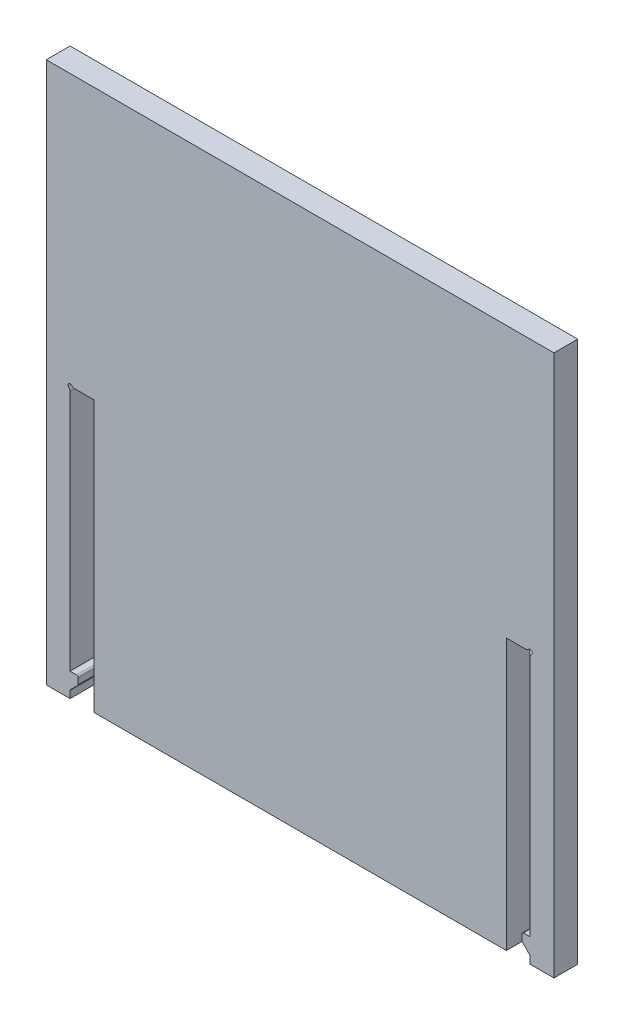
ISO-10303-21;
HEADER;
FILE_DESCRIPTION(('STEP AP214'),'2;1');
FILE_NAME('part.step','',(''),(''),'','','');
FILE_SCHEMA(('AUTOMOTIVE_DESIGN { 1 0 10303 214 1 1 1 1 }'));
ENDSEC;
DATA;
#1=APPLICATION_CONTEXT('core data for automotive mechanical design processes');
#2=APPLICATION_PROTOCOL_DEFINITION('international standard','automotive_design',2000,#1);
#3=PRODUCT_CONTEXT('',#1,'mechanical');
#4=PRODUCT('Part','Part','',(#3));
#5=PRODUCT_RELATED_PRODUCT_CATEGORY('part','',(#4));
#6=PRODUCT_DEFINITION_FORMATION('','',#4);
#7=PRODUCT_DEFINITION_CONTEXT('part definition',#1,'design');
#8=PRODUCT_DEFINITION('design','',#6,#7);
#9=PRODUCT_DEFINITION_SHAPE('','',#8);
#10=(LENGTH_UNIT() NAMED_UNIT(*) SI_UNIT(.MILLI.,.METRE.));
#11=(NAMED_UNIT(*) PLANE_ANGLE_UNIT() SI_UNIT($,.RADIAN.));
#12=(NAMED_UNIT(*) SI_UNIT($,.STERADIAN.) SOLID_ANGLE_UNIT());
#13=UNCERTAINTY_MEASURE_WITH_UNIT(LENGTH_MEASURE(1.E-05),#10,'distance_accuracy_value','');
#14=(GEOMETRIC_REPRESENTATION_CONTEXT(3) GLOBAL_UNCERTAINTY_ASSIGNED_CONTEXT((#13)) GLOBAL_UNIT_ASSIGNED_CONTEXT((#10,
#11,#12)) REPRESENTATION_CONTEXT('',''));
#15=CARTESIAN_POINT('',(0.,0.,0.));
#16=DIRECTION('',(0.,0.,1.));
#17=DIRECTION('',(1.,0.,0.));
#18=AXIS2_PLACEMENT_3D('',#15,#16,#17);
#19=CARTESIAN_POINT('',(28.329999982,-33.3375,0.));
#20=DIRECTION('',(-1.,0.,0.));
#21=DIRECTION('',(0.,0.,1.));
#22=AXIS2_PLACEMENT_3D('',#19,#20,#21);
#23=PLANE('',#22);
#24=DIRECTION('',(0.,-1.,0.));
#25=VECTOR('',#24,1.);
#26=CARTESIAN_POINT('',(28.329999982,-33.3375,2.929999982));
#27=LINE('',#26,#25);
#28=CARTESIAN_POINT('',(28.329999982,-0.559016994374946,2.929999982));
#29=VERTEX_POINT('',#28);
#30=CARTESIAN_POINT('',(28.329999982,-30.407500018,2.929999982));
#31=VERTEX_POINT('',#30);
#32=EDGE_CURVE('E385',#29,#31,#27,.T.);
#33=ORIENTED_EDGE('',*,*,#32,.F.);
#34=DIRECTION('',(0.,0.,1.));
#35=VECTOR('',#34,1.);
#36=CARTESIAN_POINT('',(28.329999982,-0.559016994374946,0.));
#37=LINE('',#36,#35);
#38=CARTESIAN_POINT('',(28.329999982,-0.559016994374946,0.));
#39=VERTEX_POINT('',#38);
#40=EDGE_CURVE('E370',#29,#39,#37,.F.);
#41=ORIENTED_EDGE('',*,*,#40,.T.);
#42=DIRECTION('',(0.,-1.,0.));
#43=VECTOR('',#42,1.);
#44=CARTESIAN_POINT('',(28.329999982,-33.3375,0.));
#45=LINE('',#44,#43);
#46=CARTESIAN_POINT('',(28.329999982,-30.407500018,0.));
#47=VERTEX_POINT('',#46);
#48=EDGE_CURVE('E402',#39,#47,#45,.T.);
#49=ORIENTED_EDGE('',*,*,#48,.T.);
#50=DIRECTION('',(0.,0.,1.));
#51=VECTOR('',#50,1.);
#52=CARTESIAN_POINT('',(28.329999982,-30.407500018,-2.23606529421839));
#53=LINE('',#52,#51);
#54=EDGE_CURVE('E392',#47,#31,#53,.T.);
#55=ORIENTED_EDGE('',*,*,#54,.T.);
#56=EDGE_LOOP('',(#33,#41,#49,#55));
#57=FACE_BOUND('',#56,.T.);
#58=ADVANCED_FACE('F39',(#57),#23,.T.);
#59=CARTESIAN_POINT('',(28.329999982,0.,0.));
#60=DIRECTION('',(0.,-1.,0.));
#61=DIRECTION('',(0.,0.,-1.));
#62=AXIS2_PLACEMENT_3D('',#59,#60,#61);
#63=PLANE('',#62);
#64=DIRECTION('',(1.,0.,0.));
#65=VECTOR('',#64,1.);
#66=CARTESIAN_POINT('',(28.329999982,0.,0.));
#67=LINE('',#66,#65);
#68=CARTESIAN_POINT('',(25.4,0.,0.));
#69=VERTEX_POINT('',#68);
#70=CARTESIAN_POINT('',(27.7709829876251,0.,0.));
#71=VERTEX_POINT('',#70);
#72=EDGE_CURVE('E271',#69,#71,#67,.T.);
#73=ORIENTED_EDGE('',*,*,#72,.T.);
#74=DIRECTION('',(0.,0.,1.));
#75=VECTOR('',#74,1.);
#76=CARTESIAN_POINT('',(27.7709829876251,0.,0.));
#77=LINE('',#76,#75);
#78=CARTESIAN_POINT('',(27.7709829876251,0.,2.929999982));
#79=VERTEX_POINT('',#78);
#80=EDGE_CURVE('E11',#71,#79,#77,.T.);
#81=ORIENTED_EDGE('',*,*,#80,.T.);
#82=DIRECTION('',(1.,0.,0.));
#83=VECTOR('',#82,1.);
#84=CARTESIAN_POINT('',(28.329999982,0.,2.929999982));
#85=LINE('',#84,#83);
#86=CARTESIAN_POINT('',(25.4,0.,2.929999982));
#87=VERTEX_POINT('',#86);
#88=EDGE_CURVE('E394',#87,#79,#85,.T.);
#89=ORIENTED_EDGE('',*,*,#88,.F.);
#90=DIRECTION('',(0.,0.,1.));
#91=VECTOR('',#90,1.);
#92=CARTESIAN_POINT('',(25.4,0.,0.));
#93=LINE('',#92,#91);
#94=EDGE_CURVE('E262',#69,#87,#93,.T.);
#95=ORIENTED_EDGE('',*,*,#94,.F.);
#96=EDGE_LOOP('',(#73,#81,#89,#95));
#97=FACE_BOUND('',#96,.T.);
#98=ADVANCED_FACE('F530',(#97),#63,.T.);
#99=CARTESIAN_POINT('',(28.329999982,-32.4903407304746,2.929999982));
#100=VERTEX_POINT('',#99);
#101=CARTESIAN_POINT('',(28.329999982,-33.3375,2.929999982));
#102=VERTEX_POINT('',#101);
#103=EDGE_CURVE('E395',#100,#102,#27,.T.);
#104=ORIENTED_EDGE('',*,*,#103,.F.);
#105=DIRECTION('',(0.,0.,1.));
#106=VECTOR('',#105,1.);
#107=CARTESIAN_POINT('',(28.329999982,-32.4903407304746,0.));
#108=LINE('',#107,#106);
#109=CARTESIAN_POINT('',(28.329999982,-32.4903407304746,0.));
#110=VERTEX_POINT('',#109);
#111=EDGE_CURVE('E361',#100,#110,#108,.F.);
#112=ORIENTED_EDGE('',*,*,#111,.T.);
#113=CARTESIAN_POINT('',(28.329999982,-33.3375,0.));
#114=VERTEX_POINT('',#113);
#115=EDGE_CURVE('E425',#110,#114,#45,.T.);
#116=ORIENTED_EDGE('',*,*,#115,.T.);
#117=DIRECTION('',(0.,0.,1.));
#118=VECTOR('',#117,1.);
#119=CARTESIAN_POINT('',(28.329999982,-33.3375,0.));
#120=LINE('',#119,#118);
#121=EDGE_CURVE('E261',#114,#102,#120,.T.);
#122=ORIENTED_EDGE('',*,*,#121,.T.);
#123=EDGE_LOOP('',(#104,#112,#116,#122));
#124=FACE_BOUND('',#123,.T.);
#125=ADVANCED_FACE('F532',(#124),#23,.T.);
#126=CARTESIAN_POINT('',(-31.259999964,-33.3375,2.929999982));
#127=DIRECTION('',(0.,1.,0.));
#128=DIRECTION('',(0.,0.,1.));
#129=AXIS2_PLACEMENT_3D('',#126,#127,#128);
#130=PLANE('',#129);
#131=ORIENTED_EDGE('',*,*,#121,.F.);
#132=DIRECTION('',(1.,0.,0.));
#133=VECTOR('',#132,1.);
#134=CARTESIAN_POINT('',(-31.259999964,-33.3375,0.));
#135=LINE('',#134,#133);
#136=CARTESIAN_POINT('',(31.259999964,-33.3375,0.));
#137=VERTEX_POINT('',#136);
#138=EDGE_CURVE('E277',#114,#137,#135,.T.);
#139=ORIENTED_EDGE('',*,*,#138,.T.);
#140=DIRECTION('',(0.,0.,-1.));
#141=VECTOR('',#140,1.);
#142=CARTESIAN_POINT('',(31.259999964,-33.3375,2.929999982));
#143=LINE('',#142,#141);
#144=CARTESIAN_POINT('',(31.259999964,-33.3375,2.929999982));
#145=VERTEX_POINT('',#144);
#146=EDGE_CURVE('E285',#145,#137,#143,.T.);
#147=ORIENTED_EDGE('',*,*,#146,.F.);
#148=DIRECTION('',(1.,0.,0.));
#149=VECTOR('',#148,1.);
#150=CARTESIAN_POINT('',(-31.259999964,-33.3375,2.929999982));
#151=LINE('',#150,#149);
#152=EDGE_CURVE('E490',#102,#145,#151,.T.);
#153=ORIENTED_EDGE('',*,*,#152,.F.);
#154=EDGE_LOOP('',(#131,#139,#147,#153));
#155=FACE_BOUND('',#154,.T.);
#156=ADVANCED_FACE('F540',(#155),#130,.F.);
#157=DIRECTION('',(0.,0.,1.));
#158=VECTOR('',#157,1.);
#159=CARTESIAN_POINT('',(25.4,-33.3375,0.));
#160=LINE('',#159,#158);
#161=CARTESIAN_POINT('',(25.4,-33.3375,0.));
#162=VERTEX_POINT('',#161);
#163=CARTESIAN_POINT('',(25.4,-33.3375,2.929999982));
#164=VERTEX_POINT('',#163);
#165=EDGE_CURVE('E250',#162,#164,#160,.T.);
#166=ORIENTED_EDGE('',*,*,#165,.T.);
#167=CARTESIAN_POINT('',(-25.4,-33.3375,2.929999982));
#168=VERTEX_POINT('',#167);
#169=EDGE_CURVE('E493',#168,#164,#151,.T.);
#170=ORIENTED_EDGE('',*,*,#169,.F.);
#171=DIRECTION('',(0.,0.,1.));
#172=VECTOR('',#171,1.);
#173=CARTESIAN_POINT('',(-25.4,-33.3375,0.));
#174=LINE('',#173,#172);
#175=CARTESIAN_POINT('',(-25.4,-33.3375,0.));
#176=VERTEX_POINT('',#175);
#177=EDGE_CURVE('E275',#176,#168,#174,.T.);
#178=ORIENTED_EDGE('',*,*,#177,.F.);
#179=EDGE_CURVE('E269',#176,#162,#135,.T.);
#180=ORIENTED_EDGE('',*,*,#179,.T.);
#181=EDGE_LOOP('',(#166,#170,#178,#180));
#182=FACE_BOUND('',#181,.T.);
#183=ADVANCED_FACE('F274',(#182),#130,.F.);
#184=CARTESIAN_POINT('',(0.,0.,2.929999982));
#185=DIRECTION('',(0.,0.,1.));
#186=DIRECTION('',(1.,0.,0.));
#187=AXIS2_PLACEMENT_3D('',#184,#185,#186);
#188=PLANE('',#187);
#189=CARTESIAN_POINT('',(28.329999982,0.,2.929999982));
#190=DIRECTION('',(0.,0.,-1.));
#191=DIRECTION('',(-1.,0.,0.));
#192=AXIS2_PLACEMENT_3D('',#189,#190,#191);
#193=CIRCLE('',#192,0.25);
#194=CARTESIAN_POINT('',(28.143660983875,0.166666666666666,2.929999982));
#195=VERTEX_POINT('',#194);
#196=CARTESIAN_POINT('',(28.4966666486667,-0.186338998124983,2.929999982));
#197=VERTEX_POINT('',#196);
#198=EDGE_CURVE('E387',#195,#197,#193,.T.);
#199=ORIENTED_EDGE('',*,*,#198,.T.);
#200=CARTESIAN_POINT('',(28.829999982,-0.559016994374946,2.929999982));
#201=DIRECTION('',(0.,0.,1.));
#202=DIRECTION('',(1.,0.,0.));
#203=AXIS2_PLACEMENT_3D('',#200,#201,#202);
#204=CIRCLE('',#203,0.5);
#205=EDGE_CURVE('E47',#197,#29,#204,.T.);
#206=ORIENTED_EDGE('',*,*,#205,.T.);
#207=ORIENTED_EDGE('',*,*,#32,.T.);
#208=DIRECTION('',(-1.,0.,0.));
#209=VECTOR('',#208,1.);
#210=CARTESIAN_POINT('',(1.05497419248819E-13,-30.4075000180001,2.929999982));
#211=LINE('',#210,#209);
#212=CARTESIAN_POINT('',(27.530001982,-30.407500018,2.929999982));
#213=VERTEX_POINT('',#212);
#214=EDGE_CURVE('E407',#31,#213,#211,.T.);
#215=ORIENTED_EDGE('',*,*,#214,.T.);
#216=CARTESIAN_POINT('',(27.530001982,-30.607500018,2.929999982));
#217=DIRECTION('',(0.,0.,1.));
#218=DIRECTION('',(1.,0.,0.));
#219=AXIS2_PLACEMENT_3D('',#216,#217,#218);
#220=CIRCLE('',#219,0.2);
#221=CARTESIAN_POINT('',(27.330001982,-30.607500018,2.929999982));
#222=VERTEX_POINT('',#221);
#223=EDGE_CURVE('E348',#213,#222,#220,.T.);
#224=ORIENTED_EDGE('',*,*,#223,.T.);
#225=DIRECTION('',(0.,-1.,0.));
#226=VECTOR('',#225,1.);
#227=CARTESIAN_POINT('',(27.330001982,0.,2.929999982));
#228=LINE('',#227,#226);
#229=CARTESIAN_POINT('',(27.330001982,-31.3246573055254,2.929999982));
#230=VERTEX_POINT('',#229);
#231=EDGE_CURVE('E420',#222,#230,#228,.T.);
#232=ORIENTED_EDGE('',*,*,#231,.T.);
#233=CARTESIAN_POINT('',(27.530001982,-31.3246573055254,2.929999982));
#234=DIRECTION('',(0.,0.,1.));
#235=DIRECTION('',(1.,0.,0.));
#236=AXIS2_PLACEMENT_3D('',#233,#234,#235);
#237=CIRCLE('',#236,0.2);
#238=CARTESIAN_POINT('',(27.3885806257627,-31.4660786617627,2.929999982));
#239=VERTEX_POINT('',#238);
#240=EDGE_CURVE('E350',#230,#239,#237,.T.);
#241=ORIENTED_EDGE('',*,*,#240,.T.);
#242=DIRECTION('',(0.707106781186548,-0.707106781186548,0.));
#243=VECTOR('',#242,1.);
#244=CARTESIAN_POINT('',(-2.03874901800001,-2.03874901800001,2.929999982));
#245=LINE('',#244,#243);
#246=CARTESIAN_POINT('',(28.2714213382373,-32.3489193742373,2.929999982));
#247=VERTEX_POINT('',#246);
#248=EDGE_CURVE('E404',#239,#247,#245,.T.);
#249=ORIENTED_EDGE('',*,*,#248,.T.);
#250=CARTESIAN_POINT('',(28.129999982,-32.4903407304746,2.929999982));
#251=DIRECTION('',(0.,0.,1.));
#252=DIRECTION('',(1.,0.,0.));
#253=AXIS2_PLACEMENT_3D('',#250,#251,#252);
#254=CIRCLE('',#253,0.2);
#255=EDGE_CURVE('E366',#247,#100,#254,.F.);
#256=ORIENTED_EDGE('',*,*,#255,.T.);
#257=ORIENTED_EDGE('',*,*,#103,.T.);
#258=ORIENTED_EDGE('',*,*,#152,.T.);
#259=DIRECTION('',(0.,1.,0.));
#260=VECTOR('',#259,1.);
#261=CARTESIAN_POINT('',(31.259999964,33.3375,2.929999982));
#262=LINE('',#261,#260);
#263=CARTESIAN_POINT('',(31.259999964,33.3375,2.929999982));
#264=VERTEX_POINT('',#263);
#265=EDGE_CURVE('E280',#145,#264,#262,.T.);
#266=ORIENTED_EDGE('',*,*,#265,.T.);
#267=DIRECTION('',(-1.,0.,0.));
#268=VECTOR('',#267,1.);
#269=CARTESIAN_POINT('',(-31.259999964,33.3375,2.929999982));
#270=LINE('',#269,#268);
#271=CARTESIAN_POINT('',(-31.259999964,33.3375,2.929999982));
#272=VERTEX_POINT('',#271);
#273=EDGE_CURVE('E486',#264,#272,#270,.T.);
#274=ORIENTED_EDGE('',*,*,#273,.T.);
#275=DIRECTION('',(0.,-1.,0.));
#276=VECTOR('',#275,1.);
#277=CARTESIAN_POINT('',(-31.259999964,33.3375,2.929999982));
#278=LINE('',#277,#276);
#279=CARTESIAN_POINT('',(-31.259999964,-33.3375,2.929999982));
#280=VERTEX_POINT('',#279);
#281=EDGE_CURVE('E488',#272,#280,#278,.T.);
#282=ORIENTED_EDGE('',*,*,#281,.T.);
#283=CARTESIAN_POINT('',(-28.329999982,-33.3375,2.929999982));
#284=VERTEX_POINT('',#283);
#285=EDGE_CURVE('E289',#280,#284,#151,.T.);
#286=ORIENTED_EDGE('',*,*,#285,.T.);
#287=DIRECTION('',(0.,-1.,0.));
#288=VECTOR('',#287,1.);
#289=CARTESIAN_POINT('',(-28.329999982,-33.3375,2.929999982));
#290=LINE('',#289,#288);
#291=CARTESIAN_POINT('',(-28.329999982,-32.4903407304746,2.929999982));
#292=VERTEX_POINT('',#291);
#293=EDGE_CURVE('E447',#292,#284,#290,.T.);
#294=ORIENTED_EDGE('',*,*,#293,.F.);
#295=CARTESIAN_POINT('',(-28.129999982,-32.4903407304746,2.929999982));
#296=DIRECTION('',(0.,0.,1.));
#297=DIRECTION('',(1.,0.,0.));
#298=AXIS2_PLACEMENT_3D('',#295,#296,#297);
#299=CIRCLE('',#298,0.2);
#300=CARTESIAN_POINT('',(-28.2714213382373,-32.3489193742373,2.929999982));
#301=VERTEX_POINT('',#300);
#302=EDGE_CURVE('E321',#292,#301,#299,.F.);
#303=ORIENTED_EDGE('',*,*,#302,.T.);
#304=DIRECTION('',(-0.707106781186548,-0.707106781186548,0.));
#305=VECTOR('',#304,1.);
#306=CARTESIAN_POINT('',(2.03874901800001,-2.03874901800001,2.929999982));
#307=LINE('',#306,#305);
#308=CARTESIAN_POINT('',(-27.3885806257627,-31.4660786617627,2.929999982));
#309=VERTEX_POINT('',#308);
#310=EDGE_CURVE('E437',#309,#301,#307,.T.);
#311=ORIENTED_EDGE('',*,*,#310,.F.);
#312=CARTESIAN_POINT('',(-27.530001982,-31.3246573055254,2.929999982));
#313=DIRECTION('',(0.,0.,1.));
#314=DIRECTION('',(1.,0.,0.));
#315=AXIS2_PLACEMENT_3D('',#312,#313,#314);
#316=CIRCLE('',#315,0.2);
#317=CARTESIAN_POINT('',(-27.330001982,-31.3246573055254,2.929999982));
#318=VERTEX_POINT('',#317);
#319=EDGE_CURVE('E305',#309,#318,#316,.T.);
#320=ORIENTED_EDGE('',*,*,#319,.T.);
#321=DIRECTION('',(0.,-1.,0.));
#322=VECTOR('',#321,1.);
#323=CARTESIAN_POINT('',(-27.330001982,0.,2.929999982));
#324=LINE('',#323,#322);
#325=CARTESIAN_POINT('',(-27.330001982,-30.607500018,2.929999982));
#326=VERTEX_POINT('',#325);
#327=EDGE_CURVE('E450',#326,#318,#324,.T.);
#328=ORIENTED_EDGE('',*,*,#327,.F.);
#329=CARTESIAN_POINT('',(-27.530001982,-30.607500018,2.929999982));
#330=DIRECTION('',(0.,0.,1.));
#331=DIRECTION('',(1.,0.,0.));
#332=AXIS2_PLACEMENT_3D('',#329,#330,#331);
#333=CIRCLE('',#332,0.2);
#334=CARTESIAN_POINT('',(-27.530001982,-30.407500018,2.929999982));
#335=VERTEX_POINT('',#334);
#336=EDGE_CURVE('E303',#326,#335,#333,.T.);
#337=ORIENTED_EDGE('',*,*,#336,.T.);
#338=DIRECTION('',(1.,0.,0.));
#339=VECTOR('',#338,1.);
#340=CARTESIAN_POINT('',(-1.05497419248819E-13,-30.4075000180001,2.929999982));
#341=LINE('',#340,#339);
#342=CARTESIAN_POINT('',(-28.329999982,-30.407500018,2.929999982));
#343=VERTEX_POINT('',#342);
#344=EDGE_CURVE('E453',#343,#335,#341,.T.);
#345=ORIENTED_EDGE('',*,*,#344,.F.);
#346=CARTESIAN_POINT('',(-28.329999982,-0.559016994374946,2.929999982));
#347=VERTEX_POINT('',#346);
#348=EDGE_CURVE('E470',#347,#343,#290,.T.);
#349=ORIENTED_EDGE('',*,*,#348,.F.);
#350=CARTESIAN_POINT('',(-28.829999982,-0.559016994374946,2.929999982));
#351=DIRECTION('',(0.,0.,1.));
#352=DIRECTION('',(1.,0.,0.));
#353=AXIS2_PLACEMENT_3D('',#350,#351,#352);
#354=CIRCLE('',#353,0.5);
#355=CARTESIAN_POINT('',(-28.4966666486667,-0.186338998124983,2.929999982));
#356=VERTEX_POINT('',#355);
#357=EDGE_CURVE('E330',#347,#356,#354,.T.);
#358=ORIENTED_EDGE('',*,*,#357,.T.);
#359=CARTESIAN_POINT('',(-28.329999982,0.,2.929999982));
#360=DIRECTION('',(0.,0.,1.));
#361=DIRECTION('',(1.,0.,0.));
#362=AXIS2_PLACEMENT_3D('',#359,#360,#361);
#363=CIRCLE('',#362,0.25);
#364=CARTESIAN_POINT('',(-28.143660983875,0.166666666666666,2.929999982));
#365=VERTEX_POINT('',#364);
#366=EDGE_CURVE('E431',#365,#356,#363,.T.);
#367=ORIENTED_EDGE('',*,*,#366,.F.);
#368=CARTESIAN_POINT('',(-27.7709829876251,0.5,2.929999982));
#369=DIRECTION('',(0.,0.,1.));
#370=DIRECTION('',(1.,0.,0.));
#371=AXIS2_PLACEMENT_3D('',#368,#369,#370);
#372=CIRCLE('',#371,0.5);
#373=CARTESIAN_POINT('',(-27.7709829876251,0.,2.929999982));
#374=VERTEX_POINT('',#373);
#375=EDGE_CURVE('E328',#365,#374,#372,.T.);
#376=ORIENTED_EDGE('',*,*,#375,.T.);
#377=DIRECTION('',(-1.,0.,0.));
#378=VECTOR('',#377,1.);
#379=CARTESIAN_POINT('',(-28.329999982,0.,2.929999982));
#380=LINE('',#379,#378);
#381=CARTESIAN_POINT('',(-25.4,0.,2.929999982));
#382=VERTEX_POINT('',#381);
#383=EDGE_CURVE('E475',#382,#374,#380,.T.);
#384=ORIENTED_EDGE('',*,*,#383,.F.);
#385=DIRECTION('',(0.,1.,0.));
#386=VECTOR('',#385,1.);
#387=CARTESIAN_POINT('',(-25.4,-33.3375,2.929999982));
#388=LINE('',#387,#386);
#389=EDGE_CURVE('E472',#168,#382,#388,.T.);
#390=ORIENTED_EDGE('',*,*,#389,.F.);
#391=ORIENTED_EDGE('',*,*,#169,.T.);
#392=DIRECTION('',(0.,1.,0.));
#393=VECTOR('',#392,1.);
#394=CARTESIAN_POINT('',(25.4,-33.3375,2.929999982));
#395=LINE('',#394,#393);
#396=EDGE_CURVE('E256',#164,#87,#395,.T.);
#397=ORIENTED_EDGE('',*,*,#396,.T.);
#398=ORIENTED_EDGE('',*,*,#88,.T.);
#399=CARTESIAN_POINT('',(27.7709829876251,0.5,2.929999982));
#400=DIRECTION('',(0.,0.,1.));
#401=DIRECTION('',(1.,0.,0.));
#402=AXIS2_PLACEMENT_3D('',#399,#400,#401);
#403=CIRCLE('',#402,0.5);
#404=EDGE_CURVE('E54',#79,#195,#403,.T.);
#405=ORIENTED_EDGE('',*,*,#404,.T.);
#406=EDGE_LOOP('',(#199,#206,#207,#215,#224,#232,#241,#249,#256,#257,#258,#266,#274,#282,#286,
#294,#303,#311,#320,#328,#337,#345,#349,#358,#367,#376,#384,#390,#391,#397,#398,#405));
#407=FACE_BOUND('',#406,.T.);
#408=ADVANCED_FACE('F383',(#407),#188,.T.);
#409=CARTESIAN_POINT('',(0.,0.,0.));
#410=DIRECTION('',(0.,0.,1.));
#411=DIRECTION('',(1.,0.,0.));
#412=AXIS2_PLACEMENT_3D('',#409,#410,#411);
#413=PLANE('',#412);
#414=ORIENTED_EDGE('',*,*,#48,.F.);
#415=CARTESIAN_POINT('',(28.829999982,-0.559016994374946,0.));
#416=DIRECTION('',(0.,0.,1.));
#417=DIRECTION('',(1.,0.,0.));
#418=AXIS2_PLACEMENT_3D('',#415,#416,#417);
#419=CIRCLE('',#418,0.5);
#420=CARTESIAN_POINT('',(28.4966666486667,-0.186338998124983,0.));
#421=VERTEX_POINT('',#420);
#422=EDGE_CURVE('E375',#39,#421,#419,.F.);
#423=ORIENTED_EDGE('',*,*,#422,.T.);
#424=CARTESIAN_POINT('',(28.329999982,0.,0.));
#425=DIRECTION('',(0.,0.,-1.));
#426=DIRECTION('',(-1.,0.,0.));
#427=AXIS2_PLACEMENT_3D('',#424,#425,#426);
#428=CIRCLE('',#427,0.25);
#429=CARTESIAN_POINT('',(28.143660983875,0.166666666666666,0.));
#430=VERTEX_POINT('',#429);
#431=EDGE_CURVE('E399',#430,#421,#428,.T.);
#432=ORIENTED_EDGE('',*,*,#431,.F.);
#433=CARTESIAN_POINT('',(27.7709829876251,0.5,0.));
#434=DIRECTION('',(0.,0.,1.));
#435=DIRECTION('',(1.,0.,0.));
#436=AXIS2_PLACEMENT_3D('',#433,#434,#435);
#437=CIRCLE('',#436,0.5);
#438=EDGE_CURVE('E373',#430,#71,#437,.F.);
#439=ORIENTED_EDGE('',*,*,#438,.T.);
#440=ORIENTED_EDGE('',*,*,#72,.F.);
#441=DIRECTION('',(0.,1.,0.));
#442=VECTOR('',#441,1.);
#443=CARTESIAN_POINT('',(25.4,-33.3375,0.));
#444=LINE('',#443,#442);
#445=EDGE_CURVE('E253',#162,#69,#444,.T.);
#446=ORIENTED_EDGE('',*,*,#445,.F.);
#447=ORIENTED_EDGE('',*,*,#179,.F.);
#448=DIRECTION('',(0.,1.,0.));
#449=VECTOR('',#448,1.);
#450=CARTESIAN_POINT('',(-25.4,-33.3375,0.));
#451=LINE('',#450,#449);
#452=CARTESIAN_POINT('',(-25.4,0.,0.));
#453=VERTEX_POINT('',#452);
#454=EDGE_CURVE('E463',#176,#453,#451,.T.);
#455=ORIENTED_EDGE('',*,*,#454,.T.);
#456=DIRECTION('',(-1.,0.,0.));
#457=VECTOR('',#456,1.);
#458=CARTESIAN_POINT('',(-28.329999982,0.,0.));
#459=LINE('',#458,#457);
#460=CARTESIAN_POINT('',(-27.7709829876251,0.,0.));
#461=VERTEX_POINT('',#460);
#462=EDGE_CURVE('E466',#453,#461,#459,.T.);
#463=ORIENTED_EDGE('',*,*,#462,.T.);
#464=CARTESIAN_POINT('',(-27.7709829876251,0.5,0.));
#465=DIRECTION('',(0.,0.,1.));
#466=DIRECTION('',(1.,0.,0.));
#467=AXIS2_PLACEMENT_3D('',#464,#465,#466);
#468=CIRCLE('',#467,0.5);
#469=CARTESIAN_POINT('',(-28.143660983875,0.166666666666666,0.));
#470=VERTEX_POINT('',#469);
#471=EDGE_CURVE('E336',#461,#470,#468,.F.);
#472=ORIENTED_EDGE('',*,*,#471,.T.);
#473=CARTESIAN_POINT('',(-28.329999982,0.,0.));
#474=DIRECTION('',(0.,0.,1.));
#475=DIRECTION('',(1.,0.,0.));
#476=AXIS2_PLACEMENT_3D('',#473,#474,#475);
#477=CIRCLE('',#476,0.25);
#478=CARTESIAN_POINT('',(-28.4966666486667,-0.186338998124983,0.));
#479=VERTEX_POINT('',#478);
#480=EDGE_CURVE('E434',#470,#479,#477,.T.);
#481=ORIENTED_EDGE('',*,*,#480,.T.);
#482=CARTESIAN_POINT('',(-28.829999982,-0.559016994374946,0.));
#483=DIRECTION('',(0.,0.,1.));
#484=DIRECTION('',(1.,0.,0.));
#485=AXIS2_PLACEMENT_3D('',#482,#483,#484);
#486=CIRCLE('',#485,0.5);
#487=CARTESIAN_POINT('',(-28.329999982,-0.559016994374946,0.));
#488=VERTEX_POINT('',#487);
#489=EDGE_CURVE('E338',#479,#488,#486,.F.);
#490=ORIENTED_EDGE('',*,*,#489,.T.);
#491=DIRECTION('',(0.,-1.,0.));
#492=VECTOR('',#491,1.);
#493=CARTESIAN_POINT('',(-28.329999982,-33.3375,0.));
#494=LINE('',#493,#492);
#495=CARTESIAN_POINT('',(-28.329999982,-30.407500018,0.));
#496=VERTEX_POINT('',#495);
#497=EDGE_CURVE('E461',#488,#496,#494,.T.);
#498=ORIENTED_EDGE('',*,*,#497,.T.);
#499=DIRECTION('',(-1.,0.,0.));
#500=VECTOR('',#499,1.);
#501=CARTESIAN_POINT('',(-1.05497419248819E-13,-30.4075000180001,0.));
#502=LINE('',#501,#500);
#503=CARTESIAN_POINT('',(-27.530001982,-30.407500018,0.));
#504=VERTEX_POINT('',#503);
#505=EDGE_CURVE('E440',#504,#496,#502,.T.);
#506=ORIENTED_EDGE('',*,*,#505,.F.);
#507=CARTESIAN_POINT('',(-27.530001982,-30.607500018,0.));
#508=DIRECTION('',(0.,0.,1.));
#509=DIRECTION('',(1.,0.,0.));
#510=AXIS2_PLACEMENT_3D('',#507,#508,#509);
#511=CIRCLE('',#510,0.2);
#512=CARTESIAN_POINT('',(-27.330001982,-30.607500018,0.));
#513=VERTEX_POINT('',#512);
#514=EDGE_CURVE('E312',#504,#513,#511,.F.);
#515=ORIENTED_EDGE('',*,*,#514,.T.);
#516=DIRECTION('',(0.,1.,0.));
#517=VECTOR('',#516,1.);
#518=CARTESIAN_POINT('',(-27.330001982,0.,0.));
#519=LINE('',#518,#517);
#520=CARTESIAN_POINT('',(-27.330001982,-31.3246573055254,0.));
#521=VERTEX_POINT('',#520);
#522=EDGE_CURVE('E444',#521,#513,#519,.T.);
#523=ORIENTED_EDGE('',*,*,#522,.F.);
#524=CARTESIAN_POINT('',(-27.530001982,-31.3246573055254,0.));
#525=DIRECTION('',(0.,0.,1.));
#526=DIRECTION('',(1.,0.,0.));
#527=AXIS2_PLACEMENT_3D('',#524,#525,#526);
#528=CIRCLE('',#527,0.2);
#529=CARTESIAN_POINT('',(-27.3885806257627,-31.4660786617627,0.));
#530=VERTEX_POINT('',#529);
#531=EDGE_CURVE('E314',#521,#530,#528,.F.);
#532=ORIENTED_EDGE('',*,*,#531,.T.);
#533=DIRECTION('',(0.707106781186548,0.707106781186548,0.));
#534=VECTOR('',#533,1.);
#535=CARTESIAN_POINT('',(2.03874901800001,-2.03874901800001,0.));
#536=LINE('',#535,#534);
#537=CARTESIAN_POINT('',(-28.2714213382373,-32.3489193742373,0.));
#538=VERTEX_POINT('',#537);
#539=EDGE_CURVE('E443',#538,#530,#536,.T.);
#540=ORIENTED_EDGE('',*,*,#539,.F.);
#541=CARTESIAN_POINT('',(-28.129999982,-32.4903407304746,0.));
#542=DIRECTION('',(0.,0.,1.));
#543=DIRECTION('',(1.,0.,0.));
#544=AXIS2_PLACEMENT_3D('',#541,#542,#543);
#545=CIRCLE('',#544,0.2);
#546=CARTESIAN_POINT('',(-28.329999982,-32.4903407304746,0.));
#547=VERTEX_POINT('',#546);
#548=EDGE_CURVE('E323',#538,#547,#545,.T.);
#549=ORIENTED_EDGE('',*,*,#548,.T.);
#550=CARTESIAN_POINT('',(-28.329999982,-33.3375,0.));
#551=VERTEX_POINT('',#550);
#552=EDGE_CURVE('E464',#547,#551,#494,.T.);
#553=ORIENTED_EDGE('',*,*,#552,.T.);
#554=CARTESIAN_POINT('',(-31.259999964,-33.3375,0.));
#555=VERTEX_POINT('',#554);
#556=EDGE_CURVE('E276',#555,#551,#135,.T.);
#557=ORIENTED_EDGE('',*,*,#556,.F.);
#558=DIRECTION('',(0.,-1.,0.));
#559=VECTOR('',#558,1.);
#560=CARTESIAN_POINT('',(-31.259999964,33.3375,0.));
#561=LINE('',#560,#559);
#562=CARTESIAN_POINT('',(-31.259999964,33.3375,0.));
#563=VERTEX_POINT('',#562);
#564=EDGE_CURVE('E281',#563,#555,#561,.T.);
#565=ORIENTED_EDGE('',*,*,#564,.F.);
#566=DIRECTION('',(-1.,0.,0.));
#567=VECTOR('',#566,1.);
#568=CARTESIAN_POINT('',(-31.259999964,33.3375,0.));
#569=LINE('',#568,#567);
#570=CARTESIAN_POINT('',(31.259999964,33.3375,0.));
#571=VERTEX_POINT('',#570);
#572=EDGE_CURVE('E495',#571,#563,#569,.T.);
#573=ORIENTED_EDGE('',*,*,#572,.F.);
#574=DIRECTION('',(0.,1.,0.));
#575=VECTOR('',#574,1.);
#576=CARTESIAN_POINT('',(31.259999964,33.3375,0.));
#577=LINE('',#576,#575);
#578=EDGE_CURVE('E480',#137,#571,#577,.T.);
#579=ORIENTED_EDGE('',*,*,#578,.F.);
#580=ORIENTED_EDGE('',*,*,#138,.F.);
#581=ORIENTED_EDGE('',*,*,#115,.F.);
#582=CARTESIAN_POINT('',(28.129999982,-32.4903407304746,0.));
#583=DIRECTION('',(0.,0.,1.));
#584=DIRECTION('',(1.,0.,0.));
#585=AXIS2_PLACEMENT_3D('',#582,#583,#584);
#586=CIRCLE('',#585,0.2);
#587=CARTESIAN_POINT('',(28.2714213382373,-32.3489193742373,0.));
#588=VERTEX_POINT('',#587);
#589=EDGE_CURVE('E368',#110,#588,#586,.T.);
#590=ORIENTED_EDGE('',*,*,#589,.T.);
#591=DIRECTION('',(-0.707106781186548,0.707106781186548,0.));
#592=VECTOR('',#591,1.);
#593=CARTESIAN_POINT('',(-2.03874901800001,-2.03874901800001,0.));
#594=LINE('',#593,#592);
#595=CARTESIAN_POINT('',(27.3885806257627,-31.4660786617627,0.));
#596=VERTEX_POINT('',#595);
#597=EDGE_CURVE('E416',#588,#596,#594,.T.);
#598=ORIENTED_EDGE('',*,*,#597,.T.);
#599=CARTESIAN_POINT('',(27.530001982,-31.3246573055254,0.));
#600=DIRECTION('',(0.,0.,1.));
#601=DIRECTION('',(1.,0.,0.));
#602=AXIS2_PLACEMENT_3D('',#599,#600,#601);
#603=CIRCLE('',#602,0.2);
#604=CARTESIAN_POINT('',(27.330001982,-31.3246573055254,0.));
#605=VERTEX_POINT('',#604);
#606=EDGE_CURVE('E359',#596,#605,#603,.F.);
#607=ORIENTED_EDGE('',*,*,#606,.T.);
#608=DIRECTION('',(0.,1.,0.));
#609=VECTOR('',#608,1.);
#610=CARTESIAN_POINT('',(27.330001982,0.,0.));
#611=LINE('',#610,#609);
#612=CARTESIAN_POINT('',(27.330001982,-30.607500018,0.));
#613=VERTEX_POINT('',#612);
#614=EDGE_CURVE('E413',#605,#613,#611,.T.);
#615=ORIENTED_EDGE('',*,*,#614,.T.);
#616=CARTESIAN_POINT('',(27.530001982,-30.607500018,0.));
#617=DIRECTION('',(0.,0.,1.));
#618=DIRECTION('',(1.,0.,0.));
#619=AXIS2_PLACEMENT_3D('',#616,#617,#618);
#620=CIRCLE('',#619,0.2);
#621=CARTESIAN_POINT('',(27.530001982,-30.407500018,0.));
#622=VERTEX_POINT('',#621);
#623=EDGE_CURVE('E357',#613,#622,#620,.F.);
#624=ORIENTED_EDGE('',*,*,#623,.T.);
#625=DIRECTION('',(1.,0.,0.));
#626=VECTOR('',#625,1.);
#627=CARTESIAN_POINT('',(1.05497419248819E-13,-30.4075000180001,0.));
#628=LINE('',#627,#626);
#629=EDGE_CURVE('E411',#622,#47,#628,.T.);
#630=ORIENTED_EDGE('',*,*,#629,.T.);
#631=EDGE_LOOP('',(#414,#423,#432,#439,#440,#446,#447,#455,#463,#472,#481,#490,#498,#506,#515,
#523,#532,#540,#549,#553,#557,#565,#573,#579,#580,#581,#590,#598,#607,#615,#624,#630));
#632=FACE_BOUND('',#631,.T.);
#633=ADVANCED_FACE('F267',(#632),#413,.F.);
#634=CARTESIAN_POINT('',(-28.329999982,-33.3375,0.));
#635=DIRECTION('',(-1.,0.,0.));
#636=DIRECTION('',(0.,0.,1.));
#637=AXIS2_PLACEMENT_3D('',#634,#635,#636);
#638=PLANE('',#637);
#639=ORIENTED_EDGE('',*,*,#497,.F.);
#640=DIRECTION('',(0.,0.,1.));
#641=VECTOR('',#640,1.);
#642=CARTESIAN_POINT('',(-28.329999982,-0.559016994374946,0.));
#643=LINE('',#642,#641);
#644=EDGE_CURVE('E325',#488,#347,#643,.T.);
#645=ORIENTED_EDGE('',*,*,#644,.T.);
#646=ORIENTED_EDGE('',*,*,#348,.T.);
#647=DIRECTION('',(0.,0.,1.));
#648=VECTOR('',#647,1.);
#649=CARTESIAN_POINT('',(-28.329999982,-30.407500018,-2.23606529421839));
#650=LINE('',#649,#648);
#651=EDGE_CURVE('E456',#496,#343,#650,.T.);
#652=ORIENTED_EDGE('',*,*,#651,.F.);
#653=EDGE_LOOP('',(#639,#645,#646,#652));
#654=FACE_BOUND('',#653,.T.);
#655=ADVANCED_FACE('F665',(#654),#638,.F.);
#656=ORIENTED_EDGE('',*,*,#552,.F.);
#657=DIRECTION('',(0.,0.,1.));
#658=VECTOR('',#657,1.);
#659=CARTESIAN_POINT('',(-28.329999982,-32.4903407304746,2.929999982));
#660=LINE('',#659,#658);
#661=EDGE_CURVE('E316',#547,#292,#660,.T.);
#662=ORIENTED_EDGE('',*,*,#661,.T.);
#663=ORIENTED_EDGE('',*,*,#293,.T.);
#664=DIRECTION('',(0.,0.,1.));
#665=VECTOR('',#664,1.);
#666=CARTESIAN_POINT('',(-28.329999982,-33.3375,0.));
#667=LINE('',#666,#665);
#668=EDGE_CURVE('E469',#551,#284,#667,.T.);
#669=ORIENTED_EDGE('',*,*,#668,.F.);
#670=EDGE_LOOP('',(#656,#662,#663,#669));
#671=FACE_BOUND('',#670,.T.);
#672=ADVANCED_FACE('F513',(#671),#638,.F.);
#673=ORIENTED_EDGE('',*,*,#556,.T.);
#674=ORIENTED_EDGE('',*,*,#668,.T.);
#675=ORIENTED_EDGE('',*,*,#285,.F.);
#676=DIRECTION('',(0.,0.,-1.));
#677=VECTOR('',#676,1.);
#678=CARTESIAN_POINT('',(-31.259999964,-33.3375,2.929999982));
#679=LINE('',#678,#677);
#680=EDGE_CURVE('E288',#280,#555,#679,.T.);
#681=ORIENTED_EDGE('',*,*,#680,.T.);
#682=EDGE_LOOP('',(#673,#674,#675,#681));
#683=FACE_BOUND('',#682,.T.);
#684=ADVANCED_FACE('F506',(#683),#130,.F.);
#685=CARTESIAN_POINT('',(31.259999964,33.3375,2.929999982));
#686=DIRECTION('',(-1.,0.,0.));
#687=DIRECTION('',(0.,-1.,0.));
#688=AXIS2_PLACEMENT_3D('',#685,#686,#687);
#689=PLANE('',#688);
#690=ORIENTED_EDGE('',*,*,#578,.T.);
#691=DIRECTION('',(0.,0.,-1.));
#692=VECTOR('',#691,1.);
#693=CARTESIAN_POINT('',(31.259999964,33.3375,2.929999982));
#694=LINE('',#693,#692);
#695=EDGE_CURVE('E295',#264,#571,#694,.T.);
#696=ORIENTED_EDGE('',*,*,#695,.F.);
#697=ORIENTED_EDGE('',*,*,#265,.F.);
#698=ORIENTED_EDGE('',*,*,#146,.T.);
#699=EDGE_LOOP('',(#690,#696,#697,#698));
#700=FACE_BOUND('',#699,.T.);
#701=ADVANCED_FACE('F519',(#700),#689,.F.);
#702=CARTESIAN_POINT('',(-31.259999964,33.3375,2.929999982));
#703=DIRECTION('',(0.,-1.,0.));
#704=DIRECTION('',(0.,0.,-1.));
#705=AXIS2_PLACEMENT_3D('',#702,#703,#704);
#706=PLANE('',#705);
#707=ORIENTED_EDGE('',*,*,#572,.T.);
#708=DIRECTION('',(0.,0.,-1.));
#709=VECTOR('',#708,1.);
#710=CARTESIAN_POINT('',(-31.259999964,33.3375,2.929999982));
#711=LINE('',#710,#709);
#712=EDGE_CURVE('E292',#272,#563,#711,.T.);
#713=ORIENTED_EDGE('',*,*,#712,.F.);
#714=ORIENTED_EDGE('',*,*,#273,.F.);
#715=ORIENTED_EDGE('',*,*,#695,.T.);
#716=EDGE_LOOP('',(#707,#713,#714,#715));
#717=FACE_BOUND('',#716,.T.);
#718=ADVANCED_FACE('F517',(#717),#706,.F.);
#719=CARTESIAN_POINT('',(-31.259999964,33.3375,2.929999982));
#720=DIRECTION('',(1.,0.,0.));
#721=DIRECTION('',(0.,0.,-1.));
#722=AXIS2_PLACEMENT_3D('',#719,#720,#721);
#723=PLANE('',#722);
#724=ORIENTED_EDGE('',*,*,#564,.T.);
#725=ORIENTED_EDGE('',*,*,#680,.F.);
#726=ORIENTED_EDGE('',*,*,#281,.F.);
#727=ORIENTED_EDGE('',*,*,#712,.T.);
#728=EDGE_LOOP('',(#724,#725,#726,#727));
#729=FACE_BOUND('',#728,.T.);
#730=ADVANCED_FACE('F501',(#729),#723,.F.);
#731=CARTESIAN_POINT('',(-28.329999982,0.,0.));
#732=DIRECTION('',(0.,1.,0.));
#733=DIRECTION('',(0.,0.,1.));
#734=AXIS2_PLACEMENT_3D('',#731,#732,#733);
#735=PLANE('',#734);
#736=ORIENTED_EDGE('',*,*,#383,.T.);
#737=DIRECTION('',(0.,0.,1.));
#738=VECTOR('',#737,1.);
#739=CARTESIAN_POINT('',(-27.7709829876251,0.,0.));
#740=LINE('',#739,#738);
#741=EDGE_CURVE('E340',#374,#461,#740,.F.);
#742=ORIENTED_EDGE('',*,*,#741,.T.);
#743=ORIENTED_EDGE('',*,*,#462,.F.);
#744=DIRECTION('',(0.,0.,1.));
#745=VECTOR('',#744,1.);
#746=CARTESIAN_POINT('',(-25.4,0.,0.));
#747=LINE('',#746,#745);
#748=EDGE_CURVE('E478',#453,#382,#747,.T.);
#749=ORIENTED_EDGE('',*,*,#748,.T.);
#750=EDGE_LOOP('',(#736,#742,#743,#749));
#751=FACE_BOUND('',#750,.T.);
#752=ADVANCED_FACE('F525',(#751),#735,.F.);
#753=CARTESIAN_POINT('',(-25.4,-33.3375,0.));
#754=DIRECTION('',(1.,0.,0.));
#755=DIRECTION('',(0.,1.,0.));
#756=AXIS2_PLACEMENT_3D('',#753,#754,#755);
#757=PLANE('',#756);
#758=ORIENTED_EDGE('',*,*,#389,.T.);
#759=ORIENTED_EDGE('',*,*,#748,.F.);
#760=ORIENTED_EDGE('',*,*,#454,.F.);
#761=ORIENTED_EDGE('',*,*,#177,.T.);
#762=EDGE_LOOP('',(#758,#759,#760,#761));
#763=FACE_BOUND('',#762,.T.);
#764=ADVANCED_FACE('F737',(#763),#757,.F.);
#765=CARTESIAN_POINT('',(-27.330001982,0.,-2.23606529421839));
#766=DIRECTION('',(-1.,0.,0.));
#767=DIRECTION('',(0.,0.,1.));
#768=AXIS2_PLACEMENT_3D('',#765,#766,#767);
#769=PLANE('',#768);
#770=ORIENTED_EDGE('',*,*,#327,.T.);
#771=DIRECTION('',(0.,0.,1.));
#772=VECTOR('',#771,1.);
#773=CARTESIAN_POINT('',(-27.330001982,-31.3246573055254,-2.23606529421839));
#774=LINE('',#773,#772);
#775=EDGE_CURVE('E310',#318,#521,#774,.F.);
#776=ORIENTED_EDGE('',*,*,#775,.T.);
#777=ORIENTED_EDGE('',*,*,#522,.T.);
#778=DIRECTION('',(0.,0.,1.));
#779=VECTOR('',#778,1.);
#780=CARTESIAN_POINT('',(-27.330001982,-30.607500018,-2.23606529421839));
#781=LINE('',#780,#779);
#782=EDGE_CURVE('E307',#513,#326,#781,.T.);
#783=ORIENTED_EDGE('',*,*,#782,.T.);
#784=EDGE_LOOP('',(#770,#776,#777,#783));
#785=FACE_BOUND('',#784,.T.);
#786=ADVANCED_FACE('F803',(#785),#769,.F.);
#787=CARTESIAN_POINT('',(-1.05497419248819E-13,-30.4075000180001,-2.23606529421839));
#788=DIRECTION('',(0.,-1.,0.));
#789=DIRECTION('',(1.,0.,0.));
#790=AXIS2_PLACEMENT_3D('',#787,#788,#789);
#791=PLANE('',#790);
#792=ORIENTED_EDGE('',*,*,#344,.T.);
#793=DIRECTION('',(0.,0.,1.));
#794=VECTOR('',#793,1.);
#795=CARTESIAN_POINT('',(-27.530001982,-30.407500018,-2.23606529421839));
#796=LINE('',#795,#794);
#797=EDGE_CURVE('E319',#335,#504,#796,.F.);
#798=ORIENTED_EDGE('',*,*,#797,.T.);
#799=ORIENTED_EDGE('',*,*,#505,.T.);
#800=ORIENTED_EDGE('',*,*,#651,.T.);
#801=EDGE_LOOP('',(#792,#798,#799,#800));
#802=FACE_BOUND('',#801,.T.);
#803=ADVANCED_FACE('F792',(#802),#791,.F.);
#804=CARTESIAN_POINT('',(2.03874901800001,-2.03874901800001,-2.23606529421839));
#805=DIRECTION('',(-0.707106781186548,0.707106781186548,0.));
#806=DIRECTION('',(-0.707106781186548,-0.707106781186548,0.));
#807=AXIS2_PLACEMENT_3D('',#804,#805,#806);
#808=PLANE('',#807);
#809=ORIENTED_EDGE('',*,*,#539,.T.);
#810=DIRECTION('',(0.,0.,1.));
#811=VECTOR('',#810,1.);
#812=CARTESIAN_POINT('',(-27.3885806257627,-31.4660786617627,-2.23606529421839));
#813=LINE('',#812,#811);
#814=EDGE_CURVE('E300',#530,#309,#813,.T.);
#815=ORIENTED_EDGE('',*,*,#814,.T.);
#816=ORIENTED_EDGE('',*,*,#310,.T.);
#817=DIRECTION('',(0.,0.,1.));
#818=VECTOR('',#817,1.);
#819=CARTESIAN_POINT('',(-28.2714213382373,-32.3489193742373,0.));
#820=LINE('',#819,#818);
#821=EDGE_CURVE('E298',#301,#538,#820,.F.);
#822=ORIENTED_EDGE('',*,*,#821,.T.);
#823=EDGE_LOOP('',(#809,#815,#816,#822));
#824=FACE_BOUND('',#823,.T.);
#825=ADVANCED_FACE('F781',(#824),#808,.F.);
#826=CARTESIAN_POINT('',(-27.530001982,-31.3246573055254,-2.23606529421839));
#827=DIRECTION('',(0.,0.,1.));
#828=DIRECTION('',(1.,0.,0.));
#829=AXIS2_PLACEMENT_3D('',#826,#827,#828);
#830=CYLINDRICAL_SURFACE('',#829,0.2);
#831=ORIENTED_EDGE('',*,*,#531,.F.);
#832=ORIENTED_EDGE('',*,*,#775,.F.);
#833=ORIENTED_EDGE('',*,*,#319,.F.);
#834=ORIENTED_EDGE('',*,*,#814,.F.);
#835=EDGE_LOOP('',(#831,#832,#833,#834));
#836=FACE_BOUND('',#835,.T.);
#837=ADVANCED_FACE('F770',(#836),#830,.T.);
#838=CARTESIAN_POINT('',(-28.129999982,-32.4903407304746,0.));
#839=DIRECTION('',(0.,0.,-1.));
#840=DIRECTION('',(-1.,0.,0.));
#841=AXIS2_PLACEMENT_3D('',#838,#839,#840);
#842=CYLINDRICAL_SURFACE('',#841,0.2);
#843=ORIENTED_EDGE('',*,*,#548,.F.);
#844=ORIENTED_EDGE('',*,*,#821,.F.);
#845=ORIENTED_EDGE('',*,*,#302,.F.);
#846=ORIENTED_EDGE('',*,*,#661,.F.);
#847=EDGE_LOOP('',(#843,#844,#845,#846));
#848=FACE_BOUND('',#847,.T.);
#849=ADVANCED_FACE('F760',(#848),#842,.F.);
#850=CARTESIAN_POINT('',(-27.530001982,-30.607500018,-2.23606529421839));
#851=DIRECTION('',(0.,0.,1.));
#852=DIRECTION('',(1.,0.,0.));
#853=AXIS2_PLACEMENT_3D('',#850,#851,#852);
#854=CYLINDRICAL_SURFACE('',#853,0.2);
#855=ORIENTED_EDGE('',*,*,#514,.F.);
#856=ORIENTED_EDGE('',*,*,#797,.F.);
#857=ORIENTED_EDGE('',*,*,#336,.F.);
#858=ORIENTED_EDGE('',*,*,#782,.F.);
#859=EDGE_LOOP('',(#855,#856,#857,#858));
#860=FACE_BOUND('',#859,.T.);
#861=ADVANCED_FACE('F725',(#860),#854,.T.);
#862=CARTESIAN_POINT('',(-28.329999982,0.,0.));
#863=DIRECTION('',(0.,0.,1.));
#864=DIRECTION('',(1.,0.,0.));
#865=AXIS2_PLACEMENT_3D('',#862,#863,#864);
#866=CYLINDRICAL_SURFACE('',#865,0.25);
#867=ORIENTED_EDGE('',*,*,#366,.T.);
#868=DIRECTION('',(0.,0.,1.));
#869=VECTOR('',#868,1.);
#870=CARTESIAN_POINT('',(-28.4966666486667,-0.186338998124982,0.));
#871=LINE('',#870,#869);
#872=EDGE_CURVE('E334',#356,#479,#871,.F.);
#873=ORIENTED_EDGE('',*,*,#872,.T.);
#874=ORIENTED_EDGE('',*,*,#480,.F.);
#875=DIRECTION('',(0.,0.,1.));
#876=VECTOR('',#875,1.);
#877=CARTESIAN_POINT('',(-28.143660983875,0.166666666666666,0.));
#878=LINE('',#877,#876);
#879=EDGE_CURVE('E332',#470,#365,#878,.T.);
#880=ORIENTED_EDGE('',*,*,#879,.T.);
#881=EDGE_LOOP('',(#867,#873,#874,#880));
#882=FACE_BOUND('',#881,.T.);
#883=ADVANCED_FACE('F601',(#882),#866,.F.);
#884=CARTESIAN_POINT('',(-28.829999982,-0.559016994374946,0.));
#885=DIRECTION('',(0.,0.,1.));
#886=DIRECTION('',(1.,0.,0.));
#887=AXIS2_PLACEMENT_3D('',#884,#885,#886);
#888=CYLINDRICAL_SURFACE('',#887,0.5);
#889=ORIENTED_EDGE('',*,*,#489,.F.);
#890=ORIENTED_EDGE('',*,*,#872,.F.);
#891=ORIENTED_EDGE('',*,*,#357,.F.);
#892=ORIENTED_EDGE('',*,*,#644,.F.);
#893=EDGE_LOOP('',(#889,#890,#891,#892));
#894=FACE_BOUND('',#893,.T.);
#895=ADVANCED_FACE('F595',(#894),#888,.T.);
#896=CARTESIAN_POINT('',(-27.7709829876251,0.5,0.));
#897=DIRECTION('',(0.,0.,1.));
#898=DIRECTION('',(1.,0.,0.));
#899=AXIS2_PLACEMENT_3D('',#896,#897,#898);
#900=CYLINDRICAL_SURFACE('',#899,0.5);
#901=ORIENTED_EDGE('',*,*,#375,.F.);
#902=ORIENTED_EDGE('',*,*,#879,.F.);
#903=ORIENTED_EDGE('',*,*,#471,.F.);
#904=ORIENTED_EDGE('',*,*,#741,.F.);
#905=EDGE_LOOP('',(#901,#902,#903,#904));
#906=FACE_BOUND('',#905,.T.);
#907=ADVANCED_FACE('F591',(#906),#900,.T.);
#908=CARTESIAN_POINT('',(25.4,-33.3375,0.));
#909=DIRECTION('',(1.,0.,0.));
#910=DIRECTION('',(0.,1.,0.));
#911=AXIS2_PLACEMENT_3D('',#908,#909,#910);
#912=PLANE('',#911);
#913=ORIENTED_EDGE('',*,*,#396,.F.);
#914=ORIENTED_EDGE('',*,*,#165,.F.);
#915=ORIENTED_EDGE('',*,*,#445,.T.);
#916=ORIENTED_EDGE('',*,*,#94,.T.);
#917=EDGE_LOOP('',(#913,#914,#915,#916));
#918=FACE_BOUND('',#917,.T.);
#919=ADVANCED_FACE('F252',(#918),#912,.T.);
#920=CARTESIAN_POINT('',(-2.03874901800001,-2.03874901800001,-2.23606529421839));
#921=DIRECTION('',(-0.707106781186548,-0.707106781186548,0.));
#922=DIRECTION('',(0.707106781186548,-0.707106781186548,0.));
#923=AXIS2_PLACEMENT_3D('',#920,#921,#922);
#924=PLANE('',#923);
#925=ORIENTED_EDGE('',*,*,#248,.F.);
#926=DIRECTION('',(0.,0.,1.));
#927=VECTOR('',#926,1.);
#928=CARTESIAN_POINT('',(27.3885806257627,-31.4660786617627,-2.23606529421839));
#929=LINE('',#928,#927);
#930=EDGE_CURVE('E355',#239,#596,#929,.F.);
#931=ORIENTED_EDGE('',*,*,#930,.T.);
#932=ORIENTED_EDGE('',*,*,#597,.F.);
#933=DIRECTION('',(0.,0.,1.));
#934=VECTOR('',#933,1.);
#935=CARTESIAN_POINT('',(28.2714213382373,-32.3489193742373,2.929999982));
#936=LINE('',#935,#934);
#937=EDGE_CURVE('E352',#588,#247,#936,.T.);
#938=ORIENTED_EDGE('',*,*,#937,.T.);
#939=EDGE_LOOP('',(#925,#931,#932,#938));
#940=FACE_BOUND('',#939,.T.);
#941=ADVANCED_FACE('F561',(#940),#924,.T.);
#942=CARTESIAN_POINT('',(27.330001982,0.,-2.23606529421839));
#943=DIRECTION('',(-1.,0.,0.));
#944=DIRECTION('',(0.,0.,1.));
#945=AXIS2_PLACEMENT_3D('',#942,#943,#944);
#946=PLANE('',#945);
#947=ORIENTED_EDGE('',*,*,#614,.F.);
#948=DIRECTION('',(0.,0.,1.));
#949=VECTOR('',#948,1.);
#950=CARTESIAN_POINT('',(27.330001982,-31.3246573055254,-2.23606529421839));
#951=LINE('',#950,#949);
#952=EDGE_CURVE('E345',#605,#230,#951,.T.);
#953=ORIENTED_EDGE('',*,*,#952,.T.);
#954=ORIENTED_EDGE('',*,*,#231,.F.);
#955=DIRECTION('',(0.,0.,1.));
#956=VECTOR('',#955,1.);
#957=CARTESIAN_POINT('',(27.330001982,-30.607500018,-2.23606529421839));
#958=LINE('',#957,#956);
#959=EDGE_CURVE('E343',#222,#613,#958,.F.);
#960=ORIENTED_EDGE('',*,*,#959,.T.);
#961=EDGE_LOOP('',(#947,#953,#954,#960));
#962=FACE_BOUND('',#961,.T.);
#963=ADVANCED_FACE('F569',(#962),#946,.T.);
#964=CARTESIAN_POINT('',(1.05497419248819E-13,-30.4075000180001,-2.23606529421839));
#965=DIRECTION('',(0.,1.,0.));
#966=DIRECTION('',(-1.,0.,0.));
#967=AXIS2_PLACEMENT_3D('',#964,#965,#966);
#968=PLANE('',#967);
#969=ORIENTED_EDGE('',*,*,#629,.F.);
#970=DIRECTION('',(0.,0.,1.));
#971=VECTOR('',#970,1.);
#972=CARTESIAN_POINT('',(27.530001982,-30.407500018,-2.23606529421839));
#973=LINE('',#972,#971);
#974=EDGE_CURVE('E363',#622,#213,#973,.T.);
#975=ORIENTED_EDGE('',*,*,#974,.T.);
#976=ORIENTED_EDGE('',*,*,#214,.F.);
#977=ORIENTED_EDGE('',*,*,#54,.F.);
#978=EDGE_LOOP('',(#969,#975,#976,#977));
#979=FACE_BOUND('',#978,.T.);
#980=ADVANCED_FACE('F577',(#979),#968,.T.);
#981=CARTESIAN_POINT('',(27.530001982,-31.3246573055254,-2.23606529421839));
#982=DIRECTION('',(0.,0.,1.));
#983=DIRECTION('',(1.,0.,0.));
#984=AXIS2_PLACEMENT_3D('',#981,#982,#983);
#985=CYLINDRICAL_SURFACE('',#984,0.2);
#986=ORIENTED_EDGE('',*,*,#606,.F.);
#987=ORIENTED_EDGE('',*,*,#930,.F.);
#988=ORIENTED_EDGE('',*,*,#240,.F.);
#989=ORIENTED_EDGE('',*,*,#952,.F.);
#990=EDGE_LOOP('',(#986,#987,#988,#989));
#991=FACE_BOUND('',#990,.T.);
#992=ADVANCED_FACE('F564',(#991),#985,.T.);
#993=CARTESIAN_POINT('',(28.129999982,-32.4903407304746,-2.23606529421839));
#994=DIRECTION('',(0.,0.,-1.));
#995=DIRECTION('',(-1.,0.,0.));
#996=AXIS2_PLACEMENT_3D('',#993,#994,#995);
#997=CYLINDRICAL_SURFACE('',#996,0.2);
#998=ORIENTED_EDGE('',*,*,#589,.F.);
#999=ORIENTED_EDGE('',*,*,#111,.F.);
#1000=ORIENTED_EDGE('',*,*,#255,.F.);
#1001=ORIENTED_EDGE('',*,*,#937,.F.);
#1002=EDGE_LOOP('',(#998,#999,#1000,#1001));
#1003=FACE_BOUND('',#1002,.T.);
#1004=ADVANCED_FACE('F554',(#1003),#997,.F.);
#1005=CARTESIAN_POINT('',(27.530001982,-30.607500018,-2.23606529421839));
#1006=DIRECTION('',(0.,0.,1.));
#1007=DIRECTION('',(1.,0.,0.));
#1008=AXIS2_PLACEMENT_3D('',#1005,#1006,#1007);
#1009=CYLINDRICAL_SURFACE('',#1008,0.2);
#1010=ORIENTED_EDGE('',*,*,#623,.F.);
#1011=ORIENTED_EDGE('',*,*,#959,.F.);
#1012=ORIENTED_EDGE('',*,*,#223,.F.);
#1013=ORIENTED_EDGE('',*,*,#974,.F.);
#1014=EDGE_LOOP('',(#1010,#1011,#1012,#1013));
#1015=FACE_BOUND('',#1014,.T.);
#1016=ADVANCED_FACE('F573',(#1015),#1009,.T.);
#1017=CARTESIAN_POINT('',(28.329999982,0.,0.));
#1018=DIRECTION('',(0.,0.,1.));
#1019=DIRECTION('',(1.,0.,0.));
#1020=AXIS2_PLACEMENT_3D('',#1017,#1018,#1019);
#1021=CYLINDRICAL_SURFACE('',#1020,0.25);
#1022=ORIENTED_EDGE('',*,*,#431,.T.);
#1023=DIRECTION('',(0.,0.,1.));
#1024=VECTOR('',#1023,1.);
#1025=CARTESIAN_POINT('',(28.4966666486667,-0.186338998124982,0.));
#1026=LINE('',#1025,#1024);
#1027=EDGE_CURVE('E61',#421,#197,#1026,.T.);
#1028=ORIENTED_EDGE('',*,*,#1027,.T.);
#1029=ORIENTED_EDGE('',*,*,#198,.F.);
#1030=DIRECTION('',(0.,0.,1.));
#1031=VECTOR('',#1030,1.);
#1032=CARTESIAN_POINT('',(28.143660983875,0.166666666666666,0.));
#1033=LINE('',#1032,#1031);
#1034=EDGE_CURVE('E377',#195,#430,#1033,.F.);
#1035=ORIENTED_EDGE('',*,*,#1034,.T.);
#1036=EDGE_LOOP('',(#1022,#1028,#1029,#1035));
#1037=FACE_BOUND('',#1036,.T.);
#1038=ADVANCED_FACE('F403',(#1037),#1021,.F.);
#1039=CARTESIAN_POINT('',(28.829999982,-0.559016994374946,0.));
#1040=DIRECTION('',(0.,0.,1.));
#1041=DIRECTION('',(1.,0.,0.));
#1042=AXIS2_PLACEMENT_3D('',#1039,#1040,#1041);
#1043=CYLINDRICAL_SURFACE('',#1042,0.5);
#1044=ORIENTED_EDGE('',*,*,#205,.F.);
#1045=ORIENTED_EDGE('',*,*,#1027,.F.);
#1046=ORIENTED_EDGE('',*,*,#422,.F.);
#1047=ORIENTED_EDGE('',*,*,#40,.F.);
#1048=EDGE_LOOP('',(#1044,#1045,#1046,#1047));
#1049=FACE_BOUND('',#1048,.T.);
#1050=ADVANCED_FACE('F397',(#1049),#1043,.T.);
#1051=CARTESIAN_POINT('',(27.7709829876251,0.5,0.));
#1052=DIRECTION('',(0.,0.,1.));
#1053=DIRECTION('',(1.,0.,0.));
#1054=AXIS2_PLACEMENT_3D('',#1051,#1052,#1053);
#1055=CYLINDRICAL_SURFACE('',#1054,0.5);
#1056=ORIENTED_EDGE('',*,*,#438,.F.);
#1057=ORIENTED_EDGE('',*,*,#1034,.F.);
#1058=ORIENTED_EDGE('',*,*,#404,.F.);
#1059=ORIENTED_EDGE('',*,*,#80,.F.);
#1060=EDGE_LOOP('',(#1056,#1057,#1058,#1059));
#1061=FACE_BOUND('',#1060,.T.);
#1062=ADVANCED_FACE('F41',(#1061),#1055,.T.);
#1063=CLOSED_SHELL('',(#58,#98,#125,#156,#183,#408,#633,#655,#672,#684,#701,#718,#730,#752,#764,
#786,#803,#825,#837,#849,#861,#883,#895,#907,#919,#941,#963,#980,#992,#1004,#1016,#1038,#1050,#1062));
#1064=MANIFOLD_SOLID_BREP('B2',#1063);
#1065=ADVANCED_BREP_SHAPE_REPRESENTATION('',(#18,#1064),#14);
#1066=SHAPE_DEFINITION_REPRESENTATION(#9,#1065);
ENDSEC;
END-ISO-10303-21;
